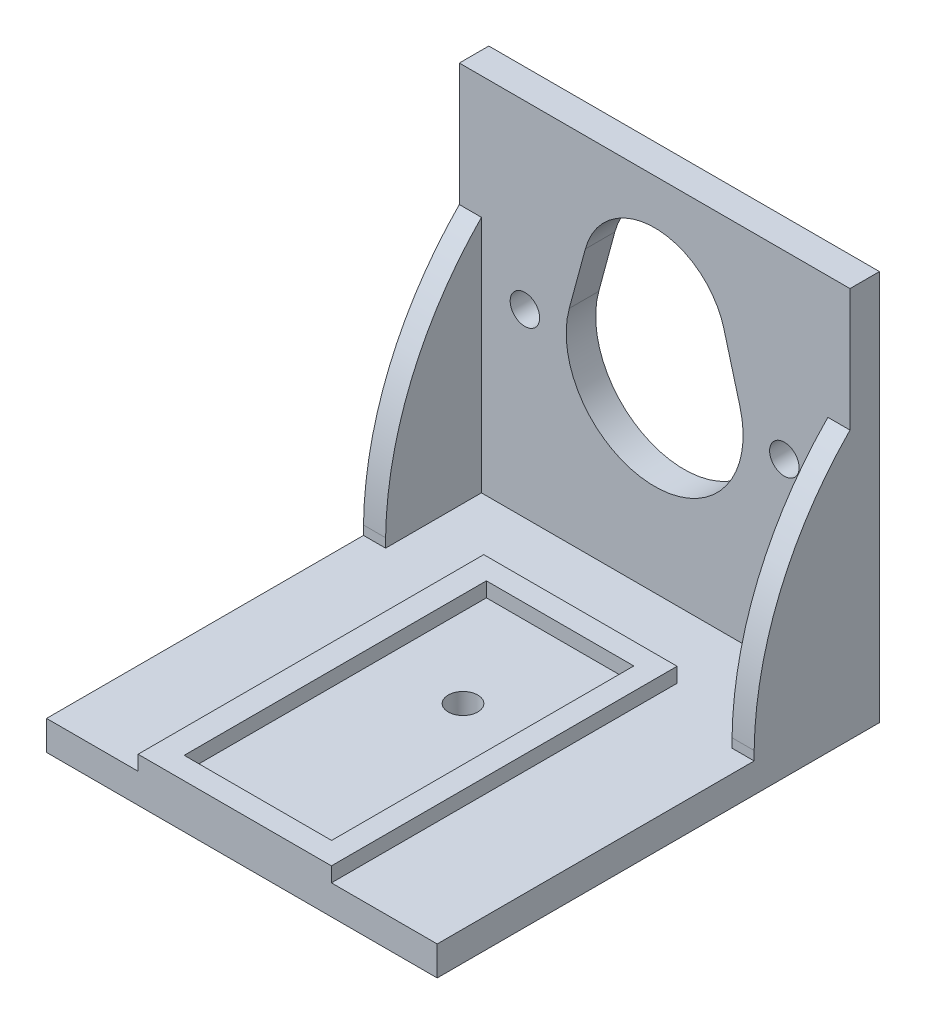
ISO-10303-21;
HEADER;
FILE_DESCRIPTION(('STEP AP214'),'2;1');
FILE_NAME('part.step','',(''),(''),'','','');
FILE_SCHEMA(('AUTOMOTIVE_DESIGN { 1 0 10303 214 1 1 1 1 }'));
ENDSEC;
DATA;
#1=APPLICATION_CONTEXT('core data for automotive mechanical design processes');
#2=APPLICATION_PROTOCOL_DEFINITION('international standard','automotive_design',2000,#1);
#3=PRODUCT_CONTEXT('',#1,'mechanical');
#4=PRODUCT('Part','Part','',(#3));
#5=PRODUCT_RELATED_PRODUCT_CATEGORY('part','',(#4));
#6=PRODUCT_DEFINITION_FORMATION('','',#4);
#7=PRODUCT_DEFINITION_CONTEXT('part definition',#1,'design');
#8=PRODUCT_DEFINITION('design','',#6,#7);
#9=PRODUCT_DEFINITION_SHAPE('','',#8);
#10=(LENGTH_UNIT() NAMED_UNIT(*) SI_UNIT(.MILLI.,.METRE.));
#11=(NAMED_UNIT(*) PLANE_ANGLE_UNIT() SI_UNIT($,.RADIAN.));
#12=(NAMED_UNIT(*) SI_UNIT($,.STERADIAN.) SOLID_ANGLE_UNIT());
#13=UNCERTAINTY_MEASURE_WITH_UNIT(LENGTH_MEASURE(1.E-05),#10,'distance_accuracy_value','');
#14=(GEOMETRIC_REPRESENTATION_CONTEXT(3) GLOBAL_UNCERTAINTY_ASSIGNED_CONTEXT((#13)) GLOBAL_UNIT_ASSIGNED_CONTEXT((#10,
#11,#12)) REPRESENTATION_CONTEXT('',''));
#15=CARTESIAN_POINT('',(0.,0.,0.));
#16=DIRECTION('',(0.,0.,1.));
#17=DIRECTION('',(1.,0.,0.));
#18=AXIS2_PLACEMENT_3D('',#15,#16,#17);
#19=CARTESIAN_POINT('',(0.,4.,60.));
#20=DIRECTION('',(0.,-1.,0.));
#21=DIRECTION('',(0.,0.,-1.));
#22=AXIS2_PLACEMENT_3D('',#19,#20,#21);
#23=PLANE('',#22);
#24=DIRECTION('',(0.,0.,-1.));
#25=VECTOR('',#24,1.);
#26=CARTESIAN_POINT('',(38.6461164607933,4.,60.));
#27=LINE('',#26,#25);
#28=CARTESIAN_POINT('',(38.6461164607933,4.,60.));
#29=VERTEX_POINT('',#28);
#30=CARTESIAN_POINT('',(38.6461164607933,4.,13.1010553588965));
#31=VERTEX_POINT('',#30);
#32=EDGE_CURVE('E275',#29,#31,#27,.T.);
#33=ORIENTED_EDGE('',*,*,#32,.F.);
#34=DIRECTION('',(-1.,0.,0.));
#35=VECTOR('',#34,1.);
#36=CARTESIAN_POINT('',(0.,4.,60.));
#37=LINE('',#36,#35);
#38=CARTESIAN_POINT('',(53.,4.,60.));
#39=VERTEX_POINT('',#38);
#40=EDGE_CURVE('E367',#39,#29,#37,.T.);
#41=ORIENTED_EDGE('',*,*,#40,.F.);
#42=DIRECTION('',(0.,0.,-1.));
#43=VECTOR('',#42,1.);
#44=CARTESIAN_POINT('',(53.,4.,60.));
#45=LINE('',#44,#43);
#46=CARTESIAN_POINT('',(53.,4.,17.));
#47=VERTEX_POINT('',#46);
#48=EDGE_CURVE('E373',#39,#47,#45,.T.);
#49=ORIENTED_EDGE('',*,*,#48,.T.);
#50=DIRECTION('',(1.,0.,0.));
#51=VECTOR('',#50,1.);
#52=CARTESIAN_POINT('',(0.,4.,17.));
#53=LINE('',#52,#51);
#54=CARTESIAN_POINT('',(50.,4.,17.));
#55=VERTEX_POINT('',#54);
#56=EDGE_CURVE('E316',#55,#47,#53,.T.);
#57=ORIENTED_EDGE('',*,*,#56,.F.);
#58=DIRECTION('',(0.,0.,1.));
#59=VECTOR('',#58,1.);
#60=CARTESIAN_POINT('',(50.,4.,60.));
#61=LINE('',#60,#59);
#62=CARTESIAN_POINT('',(50.,4.,4.));
#63=VERTEX_POINT('',#62);
#64=EDGE_CURVE('E310',#63,#55,#61,.T.);
#65=ORIENTED_EDGE('',*,*,#64,.F.);
#66=DIRECTION('',(-1.,0.,0.));
#67=VECTOR('',#66,1.);
#68=CARTESIAN_POINT('',(0.,4.,4.));
#69=LINE('',#68,#67);
#70=CARTESIAN_POINT('',(3.,4.,4.));
#71=VERTEX_POINT('',#70);
#72=EDGE_CURVE('E375',#63,#71,#69,.T.);
#73=ORIENTED_EDGE('',*,*,#72,.T.);
#74=DIRECTION('',(0.,0.,-1.));
#75=VECTOR('',#74,1.);
#76=CARTESIAN_POINT('',(3.,4.,60.));
#77=LINE('',#76,#75);
#78=CARTESIAN_POINT('',(3.,4.,17.));
#79=VERTEX_POINT('',#78);
#80=EDGE_CURVE('E12',#79,#71,#77,.T.);
#81=ORIENTED_EDGE('',*,*,#80,.F.);
#82=DIRECTION('',(-1.,0.,0.));
#83=VECTOR('',#82,1.);
#84=CARTESIAN_POINT('',(0.,4.,17.));
#85=LINE('',#84,#83);
#86=CARTESIAN_POINT('',(0.,4.,17.));
#87=VERTEX_POINT('',#86);
#88=EDGE_CURVE('E66',#79,#87,#85,.T.);
#89=ORIENTED_EDGE('',*,*,#88,.T.);
#90=DIRECTION('',(0.,0.,-1.));
#91=VECTOR('',#90,1.);
#92=CARTESIAN_POINT('',(0.,4.,60.));
#93=LINE('',#92,#91);
#94=CARTESIAN_POINT('',(0.,4.,60.));
#95=VERTEX_POINT('',#94);
#96=EDGE_CURVE('E370',#95,#87,#93,.T.);
#97=ORIENTED_EDGE('',*,*,#96,.F.);
#98=CARTESIAN_POINT('',(12.4175461324136,4.,60.));
#99=VERTEX_POINT('',#98);
#100=EDGE_CURVE('E366',#99,#95,#37,.T.);
#101=ORIENTED_EDGE('',*,*,#100,.F.);
#102=DIRECTION('',(0.,0.,-1.));
#103=VECTOR('',#102,1.);
#104=CARTESIAN_POINT('',(12.4175461324136,4.,60.));
#105=LINE('',#104,#103);
#106=CARTESIAN_POINT('',(12.4175461324136,4.,13.1010553588965));
#107=VERTEX_POINT('',#106);
#108=EDGE_CURVE('E272',#99,#107,#105,.T.);
#109=ORIENTED_EDGE('',*,*,#108,.T.);
#110=DIRECTION('',(1.,0.,0.));
#111=VECTOR('',#110,1.);
#112=CARTESIAN_POINT('',(0.,4.,13.1010553588965));
#113=LINE('',#112,#111);
#114=EDGE_CURVE('E285',#107,#31,#113,.T.);
#115=ORIENTED_EDGE('',*,*,#114,.T.);
#116=EDGE_LOOP('',(#33,#41,#49,#57,#65,#73,#81,#89,#97,#101,#109,#115));
#117=FACE_BOUND('',#116,.T.);
#118=ADVANCED_FACE('F57',(#117),#23,.F.);
#119=CARTESIAN_POINT('',(0.,0.,4.));
#120=DIRECTION('',(0.,0.,-1.));
#121=DIRECTION('',(-1.,0.,0.));
#122=AXIS2_PLACEMENT_3D('',#119,#120,#121);
#123=PLANE('',#122);
#124=DIRECTION('',(0.260962997916829,-0.96534880417301,0.));
#125=VECTOR('',#124,1.);
#126=CARTESIAN_POINT('',(43.4592200258238,11.7483424603005,4.));
#127=LINE('',#126,#125);
#128=CARTESIAN_POINT('',(35.9018011089243,39.7045867259671,4.));
#129=VERTEX_POINT('',#128);
#130=CARTESIAN_POINT('',(38.0841856500761,31.631555975002,4.));
#131=VERTEX_POINT('',#130);
#132=EDGE_CURVE('E354',#129,#131,#127,.T.);
#133=ORIENTED_EDGE('',*,*,#132,.T.);
#134=CARTESIAN_POINT('',(26.5,28.5,4.));
#135=DIRECTION('',(0.,0.,-1.));
#136=DIRECTION('',(-1.,0.,0.));
#137=AXIS2_PLACEMENT_3D('',#134,#135,#136);
#138=CIRCLE('',#137,12.);
#139=CARTESIAN_POINT('',(14.9158143499239,31.631555975002,4.));
#140=VERTEX_POINT('',#139);
#141=EDGE_CURVE('E351',#131,#140,#138,.T.);
#142=ORIENTED_EDGE('',*,*,#141,.T.);
#143=DIRECTION('',(0.26096299791683,0.96534880417301,0.));
#144=VECTOR('',#143,1.);
#145=CARTESIAN_POINT('',(5.93139060124394,-1.60343439223748,4.));
#146=LINE('',#145,#144);
#147=CARTESIAN_POINT('',(17.0981988910757,39.7045867259671,4.));
#148=VERTEX_POINT('',#147);
#149=EDGE_CURVE('E341',#140,#148,#146,.T.);
#150=ORIENTED_EDGE('',*,*,#149,.T.);
#151=CARTESIAN_POINT('',(26.5,37.1629953420066,4.));
#152=DIRECTION('',(0.,0.,-1.));
#153=DIRECTION('',(-1.,0.,0.));
#154=AXIS2_PLACEMENT_3D('',#151,#152,#153);
#155=CIRCLE('',#154,9.73927876461042);
#156=EDGE_CURVE('E356',#148,#129,#155,.T.);
#157=ORIENTED_EDGE('',*,*,#156,.T.);
#158=EDGE_LOOP('',(#133,#142,#150,#157));
#159=FACE_BOUND('',#158,.T.);
#160=CARTESIAN_POINT('',(44.1,28.5,4.));
#161=DIRECTION('',(0.,0.,-1.));
#162=DIRECTION('',(-1.,0.,0.));
#163=AXIS2_PLACEMENT_3D('',#160,#161,#162);
#164=CIRCLE('',#163,2.);
#165=CARTESIAN_POINT('',(42.1,28.5,4.));
#166=VERTEX_POINT('',#165);
#167=EDGE_CURVE('E330',#166,#166,#164,.T.);
#168=ORIENTED_EDGE('',*,*,#167,.T.);
#169=EDGE_LOOP('',(#168));
#170=FACE_BOUND('',#169,.T.);
#171=CARTESIAN_POINT('',(8.9,28.5,4.));
#172=DIRECTION('',(0.,0.,-1.));
#173=DIRECTION('',(-1.,0.,0.));
#174=AXIS2_PLACEMENT_3D('',#171,#172,#173);
#175=CIRCLE('',#174,2.);
#176=CARTESIAN_POINT('',(6.9,28.5,4.));
#177=VERTEX_POINT('',#176);
#178=EDGE_CURVE('E334',#177,#177,#175,.T.);
#179=ORIENTED_EDGE('',*,*,#178,.T.);
#180=EDGE_LOOP('',(#179));
#181=FACE_BOUND('',#180,.T.);
#182=DIRECTION('',(0.,-1.,0.));
#183=VECTOR('',#182,1.);
#184=CARTESIAN_POINT('',(50.,0.,4.));
#185=LINE('',#184,#183);
#186=CARTESIAN_POINT('',(50.,36.3738538523669,4.));
#187=VERTEX_POINT('',#186);
#188=EDGE_CURVE('E313',#187,#63,#185,.T.);
#189=ORIENTED_EDGE('',*,*,#188,.F.);
#190=DIRECTION('',(-1.,0.,0.));
#191=VECTOR('',#190,1.);
#192=CARTESIAN_POINT('',(0.,36.3738538523669,4.));
#193=LINE('',#192,#191);
#194=CARTESIAN_POINT('',(53.,36.3738538523669,4.));
#195=VERTEX_POINT('',#194);
#196=EDGE_CURVE('E308',#195,#187,#193,.T.);
#197=ORIENTED_EDGE('',*,*,#196,.F.);
#198=DIRECTION('',(0.,1.,0.));
#199=VECTOR('',#198,1.);
#200=CARTESIAN_POINT('',(53.,0.,4.));
#201=LINE('',#200,#199);
#202=CARTESIAN_POINT('',(53.,53.,4.));
#203=VERTEX_POINT('',#202);
#204=EDGE_CURVE('E381',#195,#203,#201,.T.);
#205=ORIENTED_EDGE('',*,*,#204,.T.);
#206=DIRECTION('',(-1.,0.,0.));
#207=VECTOR('',#206,1.);
#208=CARTESIAN_POINT('',(0.,53.,4.));
#209=LINE('',#208,#207);
#210=CARTESIAN_POINT('',(0.,53.,4.));
#211=VERTEX_POINT('',#210);
#212=EDGE_CURVE('E384',#203,#211,#209,.T.);
#213=ORIENTED_EDGE('',*,*,#212,.T.);
#214=DIRECTION('',(0.,-1.,0.));
#215=VECTOR('',#214,1.);
#216=CARTESIAN_POINT('',(0.,0.,4.));
#217=LINE('',#216,#215);
#218=CARTESIAN_POINT('',(0.,36.3738538523669,4.));
#219=VERTEX_POINT('',#218);
#220=EDGE_CURVE('E378',#211,#219,#217,.T.);
#221=ORIENTED_EDGE('',*,*,#220,.T.);
#222=DIRECTION('',(-1.,0.,0.));
#223=VECTOR('',#222,1.);
#224=CARTESIAN_POINT('',(0.,36.3738538523669,4.));
#225=LINE('',#224,#223);
#226=CARTESIAN_POINT('',(3.00000000000001,36.3738538523669,4.));
#227=VERTEX_POINT('',#226);
#228=EDGE_CURVE('E327',#227,#219,#225,.T.);
#229=ORIENTED_EDGE('',*,*,#228,.F.);
#230=DIRECTION('',(0.,1.,0.));
#231=VECTOR('',#230,1.);
#232=CARTESIAN_POINT('',(3.,0.,4.));
#233=LINE('',#232,#231);
#234=EDGE_CURVE('E324',#71,#227,#233,.T.);
#235=ORIENTED_EDGE('',*,*,#234,.F.);
#236=ORIENTED_EDGE('',*,*,#72,.F.);
#237=EDGE_LOOP('',(#189,#197,#205,#213,#221,#229,#235,#236));
#238=FACE_BOUND('',#237,.T.);
#239=ADVANCED_FACE('F461',(#159,#170,#181,#238),#123,.F.);
#240=CARTESIAN_POINT('',(0.,0.,4.));
#241=DIRECTION('',(1.,0.,0.));
#242=DIRECTION('',(0.,0.,-1.));
#243=AXIS2_PLACEMENT_3D('',#240,#241,#242);
#244=PLANE('',#243);
#245=DIRECTION('',(0.,-1.,0.));
#246=VECTOR('',#245,1.);
#247=CARTESIAN_POINT('',(0.,36.3738538523669,17.));
#248=LINE('',#247,#246);
#249=CARTESIAN_POINT('',(0.,5.22659799611902,17.));
#250=VERTEX_POINT('',#249);
#251=EDGE_CURVE('E319',#250,#87,#248,.T.);
#252=ORIENTED_EDGE('',*,*,#251,.F.);
#253=CARTESIAN_POINT('',(0.,4.61329899805943,-28.2829503458636));
#254=DIRECTION('',(1.,0.,0.));
#255=DIRECTION('',(0.,0.,-1.));
#256=AXIS2_PLACEMENT_3D('',#253,#254,#255);
#257=CIRCLE('',#256,45.2871033263);
#258=EDGE_CURVE('E300',#250,#219,#257,.F.);
#259=ORIENTED_EDGE('',*,*,#258,.T.);
#260=ORIENTED_EDGE('',*,*,#220,.F.);
#261=DIRECTION('',(0.,0.,-1.));
#262=VECTOR('',#261,1.);
#263=CARTESIAN_POINT('',(0.,53.,4.));
#264=LINE('',#263,#262);
#265=CARTESIAN_POINT('',(0.,53.,0.));
#266=VERTEX_POINT('',#265);
#267=EDGE_CURVE('E386',#211,#266,#264,.T.);
#268=ORIENTED_EDGE('',*,*,#267,.T.);
#269=DIRECTION('',(0.,-1.,0.));
#270=VECTOR('',#269,1.);
#271=CARTESIAN_POINT('',(0.,0.,0.));
#272=LINE('',#271,#270);
#273=CARTESIAN_POINT('',(0.,0.,0.));
#274=VERTEX_POINT('',#273);
#275=EDGE_CURVE('E377',#266,#274,#272,.T.);
#276=ORIENTED_EDGE('',*,*,#275,.T.);
#277=DIRECTION('',(0.,0.,-1.));
#278=VECTOR('',#277,1.);
#279=CARTESIAN_POINT('',(0.,0.,4.));
#280=LINE('',#279,#278);
#281=CARTESIAN_POINT('',(0.,0.,60.));
#282=VERTEX_POINT('',#281);
#283=EDGE_CURVE('E402',#282,#274,#280,.T.);
#284=ORIENTED_EDGE('',*,*,#283,.F.);
#285=DIRECTION('',(0.,-1.,0.));
#286=VECTOR('',#285,1.);
#287=CARTESIAN_POINT('',(0.,0.,60.));
#288=LINE('',#287,#286);
#289=EDGE_CURVE('E359',#95,#282,#288,.T.);
#290=ORIENTED_EDGE('',*,*,#289,.F.);
#291=ORIENTED_EDGE('',*,*,#96,.T.);
#292=EDGE_LOOP('',(#252,#259,#260,#268,#276,#284,#290,#291));
#293=FACE_BOUND('',#292,.T.);
#294=ADVANCED_FACE('F59',(#293),#244,.F.);
#295=CARTESIAN_POINT('',(0.,0.,4.));
#296=DIRECTION('',(0.,1.,0.));
#297=DIRECTION('',(0.,0.,1.));
#298=AXIS2_PLACEMENT_3D('',#295,#296,#297);
#299=PLANE('',#298);
#300=CARTESIAN_POINT('',(26.5,0.,30.));
#301=DIRECTION('',(0.,1.,0.));
#302=DIRECTION('',(0.,0.,1.));
#303=AXIS2_PLACEMENT_3D('',#300,#301,#302);
#304=CIRCLE('',#303,2.);
#305=CARTESIAN_POINT('',(26.5,0.,32.));
#306=VERTEX_POINT('',#305);
#307=EDGE_CURVE('E230',#306,#306,#304,.T.);
#308=ORIENTED_EDGE('',*,*,#307,.T.);
#309=EDGE_LOOP('',(#308));
#310=FACE_BOUND('',#309,.T.);
#311=DIRECTION('',(0.,0.,-1.));
#312=VECTOR('',#311,1.);
#313=CARTESIAN_POINT('',(53.,0.,4.));
#314=LINE('',#313,#312);
#315=CARTESIAN_POINT('',(53.,0.,60.));
#316=VERTEX_POINT('',#315);
#317=CARTESIAN_POINT('',(53.,0.,0.));
#318=VERTEX_POINT('',#317);
#319=EDGE_CURVE('E400',#316,#318,#314,.T.);
#320=ORIENTED_EDGE('',*,*,#319,.F.);
#321=DIRECTION('',(1.,0.,0.));
#322=VECTOR('',#321,1.);
#323=CARTESIAN_POINT('',(0.,0.,60.));
#324=LINE('',#323,#322);
#325=EDGE_CURVE('E362',#282,#316,#324,.T.);
#326=ORIENTED_EDGE('',*,*,#325,.F.);
#327=ORIENTED_EDGE('',*,*,#283,.T.);
#328=DIRECTION('',(1.,0.,0.));
#329=VECTOR('',#328,1.);
#330=CARTESIAN_POINT('',(0.,0.,0.));
#331=LINE('',#330,#329);
#332=EDGE_CURVE('E389',#274,#318,#331,.T.);
#333=ORIENTED_EDGE('',*,*,#332,.T.);
#334=EDGE_LOOP('',(#320,#326,#327,#333));
#335=FACE_BOUND('',#334,.T.);
#336=ADVANCED_FACE('F484',(#310,#335),#299,.F.);
#337=CARTESIAN_POINT('',(53.,0.,4.));
#338=DIRECTION('',(-1.,0.,0.));
#339=DIRECTION('',(0.,0.,1.));
#340=AXIS2_PLACEMENT_3D('',#337,#338,#339);
#341=PLANE('',#340);
#342=ORIENTED_EDGE('',*,*,#204,.F.);
#343=CARTESIAN_POINT('',(53.,4.61329899805943,-28.2829503458636));
#344=DIRECTION('',(-1.,0.,0.));
#345=DIRECTION('',(0.,0.,1.));
#346=AXIS2_PLACEMENT_3D('',#343,#344,#345);
#347=CIRCLE('',#346,45.2871033263);
#348=CARTESIAN_POINT('',(53.,5.22659799611902,17.));
#349=VERTEX_POINT('',#348);
#350=EDGE_CURVE('E297',#195,#349,#347,.F.);
#351=ORIENTED_EDGE('',*,*,#350,.T.);
#352=DIRECTION('',(0.,1.,0.));
#353=VECTOR('',#352,1.);
#354=CARTESIAN_POINT('',(53.,36.3738538523669,17.));
#355=LINE('',#354,#353);
#356=EDGE_CURVE('E305',#47,#349,#355,.T.);
#357=ORIENTED_EDGE('',*,*,#356,.F.);
#358=ORIENTED_EDGE('',*,*,#48,.F.);
#359=DIRECTION('',(0.,1.,0.));
#360=VECTOR('',#359,1.);
#361=CARTESIAN_POINT('',(53.,0.,60.));
#362=LINE('',#361,#360);
#363=EDGE_CURVE('E364',#316,#39,#362,.T.);
#364=ORIENTED_EDGE('',*,*,#363,.F.);
#365=ORIENTED_EDGE('',*,*,#319,.T.);
#366=DIRECTION('',(0.,1.,0.));
#367=VECTOR('',#366,1.);
#368=CARTESIAN_POINT('',(53.,0.,0.));
#369=LINE('',#368,#367);
#370=CARTESIAN_POINT('',(53.,53.,0.));
#371=VERTEX_POINT('',#370);
#372=EDGE_CURVE('E392',#318,#371,#369,.T.);
#373=ORIENTED_EDGE('',*,*,#372,.T.);
#374=DIRECTION('',(0.,0.,-1.));
#375=VECTOR('',#374,1.);
#376=CARTESIAN_POINT('',(53.,53.,4.));
#377=LINE('',#376,#375);
#378=EDGE_CURVE('E397',#203,#371,#377,.T.);
#379=ORIENTED_EDGE('',*,*,#378,.F.);
#380=EDGE_LOOP('',(#342,#351,#357,#358,#364,#365,#373,#379));
#381=FACE_BOUND('',#380,.T.);
#382=ADVANCED_FACE('F449',(#381),#341,.F.);
#383=CARTESIAN_POINT('',(0.,53.,4.));
#384=DIRECTION('',(0.,-1.,0.));
#385=DIRECTION('',(0.,0.,-1.));
#386=AXIS2_PLACEMENT_3D('',#383,#384,#385);
#387=PLANE('',#386);
#388=DIRECTION('',(-1.,0.,0.));
#389=VECTOR('',#388,1.);
#390=CARTESIAN_POINT('',(0.,53.,0.));
#391=LINE('',#390,#389);
#392=EDGE_CURVE('E382',#371,#266,#391,.T.);
#393=ORIENTED_EDGE('',*,*,#392,.T.);
#394=ORIENTED_EDGE('',*,*,#267,.F.);
#395=ORIENTED_EDGE('',*,*,#212,.F.);
#396=ORIENTED_EDGE('',*,*,#378,.T.);
#397=EDGE_LOOP('',(#393,#394,#395,#396));
#398=FACE_BOUND('',#397,.T.);
#399=ADVANCED_FACE('F475',(#398),#387,.F.);
#400=CARTESIAN_POINT('',(0.,0.,0.));
#401=DIRECTION('',(0.,0.,-1.));
#402=DIRECTION('',(-1.,0.,0.));
#403=AXIS2_PLACEMENT_3D('',#400,#401,#402);
#404=PLANE('',#403);
#405=ORIENTED_EDGE('',*,*,#372,.F.);
#406=ORIENTED_EDGE('',*,*,#332,.F.);
#407=ORIENTED_EDGE('',*,*,#275,.F.);
#408=ORIENTED_EDGE('',*,*,#392,.F.);
#409=EDGE_LOOP('',(#405,#406,#407,#408));
#410=FACE_BOUND('',#409,.T.);
#411=CARTESIAN_POINT('',(44.1,28.5,0.));
#412=DIRECTION('',(0.,0.,-1.));
#413=DIRECTION('',(-1.,0.,0.));
#414=AXIS2_PLACEMENT_3D('',#411,#412,#413);
#415=CIRCLE('',#414,2.);
#416=CARTESIAN_POINT('',(42.1,28.5,0.));
#417=VERTEX_POINT('',#416);
#418=EDGE_CURVE('E329',#417,#417,#415,.T.);
#419=ORIENTED_EDGE('',*,*,#418,.F.);
#420=EDGE_LOOP('',(#419));
#421=FACE_BOUND('',#420,.T.);
#422=CARTESIAN_POINT('',(8.9,28.5,0.));
#423=DIRECTION('',(0.,0.,-1.));
#424=DIRECTION('',(-1.,0.,0.));
#425=AXIS2_PLACEMENT_3D('',#422,#423,#424);
#426=CIRCLE('',#425,2.);
#427=CARTESIAN_POINT('',(6.9,28.5,0.));
#428=VERTEX_POINT('',#427);
#429=EDGE_CURVE('E333',#428,#428,#426,.T.);
#430=ORIENTED_EDGE('',*,*,#429,.F.);
#431=EDGE_LOOP('',(#430));
#432=FACE_BOUND('',#431,.T.);
#433=CARTESIAN_POINT('',(26.5,37.1629953420066,0.));
#434=DIRECTION('',(0.,0.,-1.));
#435=DIRECTION('',(-1.,0.,0.));
#436=AXIS2_PLACEMENT_3D('',#433,#434,#435);
#437=CIRCLE('',#436,9.73927876461042);
#438=CARTESIAN_POINT('',(17.0981988910757,39.7045867259671,0.));
#439=VERTEX_POINT('',#438);
#440=CARTESIAN_POINT('',(35.9018011089243,39.7045867259671,0.));
#441=VERTEX_POINT('',#440);
#442=EDGE_CURVE('E411',#439,#441,#437,.T.);
#443=ORIENTED_EDGE('',*,*,#442,.F.);
#444=DIRECTION('',(0.26096299791683,0.96534880417301,0.));
#445=VECTOR('',#444,1.);
#446=CARTESIAN_POINT('',(5.93139060124394,-1.60343439223748,0.));
#447=LINE('',#446,#445);
#448=CARTESIAN_POINT('',(14.9158143499239,31.631555975002,0.));
#449=VERTEX_POINT('',#448);
#450=EDGE_CURVE('E404',#449,#439,#447,.T.);
#451=ORIENTED_EDGE('',*,*,#450,.F.);
#452=CARTESIAN_POINT('',(26.5,28.5,0.));
#453=DIRECTION('',(0.,0.,-1.));
#454=DIRECTION('',(-1.,0.,0.));
#455=AXIS2_PLACEMENT_3D('',#452,#453,#454);
#456=CIRCLE('',#455,12.);
#457=CARTESIAN_POINT('',(38.0841856500761,31.631555975002,0.));
#458=VERTEX_POINT('',#457);
#459=EDGE_CURVE('E406',#458,#449,#456,.T.);
#460=ORIENTED_EDGE('',*,*,#459,.F.);
#461=DIRECTION('',(0.260962997916829,-0.96534880417301,0.));
#462=VECTOR('',#461,1.);
#463=CARTESIAN_POINT('',(43.4592200258238,11.7483424603005,0.));
#464=LINE('',#463,#462);
#465=EDGE_CURVE('E409',#441,#458,#464,.T.);
#466=ORIENTED_EDGE('',*,*,#465,.F.);
#467=EDGE_LOOP('',(#443,#451,#460,#466));
#468=FACE_BOUND('',#467,.T.);
#469=ADVANCED_FACE('F481',(#410,#421,#432,#468),#404,.T.);
#470=CARTESIAN_POINT('',(0.,0.,60.));
#471=DIRECTION('',(0.,0.,-1.));
#472=DIRECTION('',(-1.,0.,0.));
#473=AXIS2_PLACEMENT_3D('',#470,#471,#472);
#474=PLANE('',#473);
#475=ORIENTED_EDGE('',*,*,#325,.T.);
#476=ORIENTED_EDGE('',*,*,#363,.T.);
#477=ORIENTED_EDGE('',*,*,#40,.T.);
#478=DIRECTION('',(0.,-1.,0.));
#479=VECTOR('',#478,1.);
#480=CARTESIAN_POINT('',(38.6461164607933,6.,60.));
#481=LINE('',#480,#479);
#482=CARTESIAN_POINT('',(38.6461164607933,6.,60.));
#483=VERTEX_POINT('',#482);
#484=EDGE_CURVE('E270',#483,#29,#481,.T.);
#485=ORIENTED_EDGE('',*,*,#484,.F.);
#486=DIRECTION('',(1.,0.,0.));
#487=VECTOR('',#486,1.);
#488=CARTESIAN_POINT('',(12.4175461324136,6.,60.));
#489=LINE('',#488,#487);
#490=CARTESIAN_POINT('',(12.4175461324136,6.,60.));
#491=VERTEX_POINT('',#490);
#492=EDGE_CURVE('E237',#491,#483,#489,.T.);
#493=ORIENTED_EDGE('',*,*,#492,.F.);
#494=DIRECTION('',(0.,-1.,0.));
#495=VECTOR('',#494,1.);
#496=CARTESIAN_POINT('',(12.4175461324136,6.,60.));
#497=LINE('',#496,#495);
#498=EDGE_CURVE('E263',#491,#99,#497,.T.);
#499=ORIENTED_EDGE('',*,*,#498,.T.);
#500=ORIENTED_EDGE('',*,*,#100,.T.);
#501=ORIENTED_EDGE('',*,*,#289,.T.);
#502=EDGE_LOOP('',(#475,#476,#477,#485,#493,#499,#500,#501));
#503=FACE_BOUND('',#502,.T.);
#504=ADVANCED_FACE('F430',(#503),#474,.F.);
#505=CARTESIAN_POINT('',(26.5,37.1629953420066,-18.));
#506=DIRECTION('',(0.,0.,1.));
#507=DIRECTION('',(1.,0.,0.));
#508=AXIS2_PLACEMENT_3D('',#505,#506,#507);
#509=CYLINDRICAL_SURFACE('',#508,9.73927876461042);
#510=DIRECTION('',(0.,0.,1.));
#511=VECTOR('',#510,1.);
#512=CARTESIAN_POINT('',(17.0981988910757,39.7045867259671,-18.));
#513=LINE('',#512,#511);
#514=EDGE_CURVE('E337',#439,#148,#513,.T.);
#515=ORIENTED_EDGE('',*,*,#514,.F.);
#516=ORIENTED_EDGE('',*,*,#442,.T.);
#517=DIRECTION('',(0.,0.,1.));
#518=VECTOR('',#517,1.);
#519=CARTESIAN_POINT('',(35.9018011089243,39.7045867259671,-18.));
#520=LINE('',#519,#518);
#521=EDGE_CURVE('E338',#441,#129,#520,.T.);
#522=ORIENTED_EDGE('',*,*,#521,.T.);
#523=ORIENTED_EDGE('',*,*,#156,.F.);
#524=EDGE_LOOP('',(#515,#516,#522,#523));
#525=FACE_BOUND('',#524,.T.);
#526=ADVANCED_FACE('F653',(#525),#509,.F.);
#527=CARTESIAN_POINT('',(35.9018011089243,39.7045867259671,-18.));
#528=DIRECTION('',(0.96534880417301,0.260962997916829,0.));
#529=DIRECTION('',(-0.260962997916829,0.96534880417301,0.));
#530=AXIS2_PLACEMENT_3D('',#527,#528,#529);
#531=PLANE('',#530);
#532=ORIENTED_EDGE('',*,*,#521,.F.);
#533=ORIENTED_EDGE('',*,*,#465,.T.);
#534=DIRECTION('',(0.,0.,1.));
#535=VECTOR('',#534,1.);
#536=CARTESIAN_POINT('',(38.0841856500761,31.631555975002,-18.));
#537=LINE('',#536,#535);
#538=EDGE_CURVE('E342',#458,#131,#537,.T.);
#539=ORIENTED_EDGE('',*,*,#538,.T.);
#540=ORIENTED_EDGE('',*,*,#132,.F.);
#541=EDGE_LOOP('',(#532,#533,#539,#540));
#542=FACE_BOUND('',#541,.T.);
#543=ADVANCED_FACE('F696',(#542),#531,.F.);
#544=CARTESIAN_POINT('',(26.5,28.5,-18.));
#545=DIRECTION('',(0.,0.,1.));
#546=DIRECTION('',(1.,0.,0.));
#547=AXIS2_PLACEMENT_3D('',#544,#545,#546);
#548=CYLINDRICAL_SURFACE('',#547,12.);
#549=ORIENTED_EDGE('',*,*,#538,.F.);
#550=ORIENTED_EDGE('',*,*,#459,.T.);
#551=DIRECTION('',(0.,0.,1.));
#552=VECTOR('',#551,1.);
#553=CARTESIAN_POINT('',(14.9158143499239,31.631555975002,-18.));
#554=LINE('',#553,#552);
#555=EDGE_CURVE('E345',#449,#140,#554,.T.);
#556=ORIENTED_EDGE('',*,*,#555,.T.);
#557=ORIENTED_EDGE('',*,*,#141,.F.);
#558=EDGE_LOOP('',(#549,#550,#556,#557));
#559=FACE_BOUND('',#558,.T.);
#560=ADVANCED_FACE('F704',(#559),#548,.F.);
#561=CARTESIAN_POINT('',(17.0981988910757,39.7045867259671,-18.));
#562=DIRECTION('',(-0.96534880417301,0.26096299791683,0.));
#563=DIRECTION('',(-0.26096299791683,-0.96534880417301,0.));
#564=AXIS2_PLACEMENT_3D('',#561,#562,#563);
#565=PLANE('',#564);
#566=ORIENTED_EDGE('',*,*,#555,.F.);
#567=ORIENTED_EDGE('',*,*,#450,.T.);
#568=ORIENTED_EDGE('',*,*,#514,.T.);
#569=ORIENTED_EDGE('',*,*,#149,.F.);
#570=EDGE_LOOP('',(#566,#567,#568,#569));
#571=FACE_BOUND('',#570,.T.);
#572=ADVANCED_FACE('F711',(#571),#565,.F.);
#573=CARTESIAN_POINT('',(8.9,28.5,-15.));
#574=DIRECTION('',(0.,0.,1.));
#575=DIRECTION('',(1.,0.,0.));
#576=AXIS2_PLACEMENT_3D('',#573,#574,#575);
#577=CYLINDRICAL_SURFACE('',#576,2.);
#578=ORIENTED_EDGE('',*,*,#429,.T.);
#579=EDGE_LOOP('',(#578));
#580=FACE_BOUND('',#579,.T.);
#581=ORIENTED_EDGE('',*,*,#178,.F.);
#582=EDGE_LOOP('',(#581));
#583=FACE_BOUND('',#582,.T.);
#584=ADVANCED_FACE('F719',(#580,#583),#577,.F.);
#585=CARTESIAN_POINT('',(44.1,28.5,-15.));
#586=DIRECTION('',(0.,0.,1.));
#587=DIRECTION('',(1.,0.,0.));
#588=AXIS2_PLACEMENT_3D('',#585,#586,#587);
#589=CYLINDRICAL_SURFACE('',#588,2.);
#590=ORIENTED_EDGE('',*,*,#418,.T.);
#591=EDGE_LOOP('',(#590));
#592=FACE_BOUND('',#591,.T.);
#593=ORIENTED_EDGE('',*,*,#167,.F.);
#594=EDGE_LOOP('',(#593));
#595=FACE_BOUND('',#594,.T.);
#596=ADVANCED_FACE('F578',(#592,#595),#589,.F.);
#597=CARTESIAN_POINT('',(3.,36.3738538523669,17.));
#598=DIRECTION('',(-1.,0.,0.));
#599=DIRECTION('',(0.,-1.,0.));
#600=AXIS2_PLACEMENT_3D('',#597,#598,#599);
#601=PLANE('',#600);
#602=ORIENTED_EDGE('',*,*,#234,.T.);
#603=CARTESIAN_POINT('',(3.,4.61329899805943,-28.2829503458636));
#604=DIRECTION('',(-1.,0.,0.));
#605=DIRECTION('',(0.,-1.,0.));
#606=AXIS2_PLACEMENT_3D('',#603,#604,#605);
#607=CIRCLE('',#606,45.2871033263);
#608=CARTESIAN_POINT('',(3.,5.22659799611902,17.));
#609=VERTEX_POINT('',#608);
#610=EDGE_CURVE('E294',#227,#609,#607,.F.);
#611=ORIENTED_EDGE('',*,*,#610,.T.);
#612=DIRECTION('',(0.,1.,0.));
#613=VECTOR('',#612,1.);
#614=CARTESIAN_POINT('',(3.,36.3738538523669,17.));
#615=LINE('',#614,#613);
#616=EDGE_CURVE('E321',#79,#609,#615,.T.);
#617=ORIENTED_EDGE('',*,*,#616,.F.);
#618=ORIENTED_EDGE('',*,*,#80,.T.);
#619=EDGE_LOOP('',(#602,#611,#617,#618));
#620=FACE_BOUND('',#619,.T.);
#621=ADVANCED_FACE('F465',(#620),#601,.F.);
#622=CARTESIAN_POINT('',(0.,0.,17.));
#623=DIRECTION('',(0.,0.,1.));
#624=DIRECTION('',(1.,0.,0.));
#625=AXIS2_PLACEMENT_3D('',#622,#623,#624);
#626=PLANE('',#625);
#627=DIRECTION('',(1.,0.,0.));
#628=VECTOR('',#627,1.);
#629=CARTESIAN_POINT('',(-15.,5.22659799611902,17.));
#630=LINE('',#629,#628);
#631=EDGE_CURVE('E290',#250,#609,#630,.T.);
#632=ORIENTED_EDGE('',*,*,#631,.F.);
#633=ORIENTED_EDGE('',*,*,#251,.T.);
#634=ORIENTED_EDGE('',*,*,#88,.F.);
#635=ORIENTED_EDGE('',*,*,#616,.T.);
#636=EDGE_LOOP('',(#632,#633,#634,#635));
#637=FACE_BOUND('',#636,.T.);
#638=ADVANCED_FACE('F467',(#637),#626,.T.);
#639=CARTESIAN_POINT('',(0.,0.,17.));
#640=DIRECTION('',(0.,0.,-1.));
#641=DIRECTION('',(-1.,0.,0.));
#642=AXIS2_PLACEMENT_3D('',#639,#640,#641);
#643=PLANE('',#642);
#644=ORIENTED_EDGE('',*,*,#356,.T.);
#645=CARTESIAN_POINT('',(50.,5.22659799611902,17.));
#646=VERTEX_POINT('',#645);
#647=EDGE_CURVE('E288',#646,#349,#630,.T.);
#648=ORIENTED_EDGE('',*,*,#647,.F.);
#649=DIRECTION('',(0.,-1.,0.));
#650=VECTOR('',#649,1.);
#651=CARTESIAN_POINT('',(50.,36.3738538523669,17.));
#652=LINE('',#651,#650);
#653=EDGE_CURVE('E303',#646,#55,#652,.T.);
#654=ORIENTED_EDGE('',*,*,#653,.T.);
#655=ORIENTED_EDGE('',*,*,#56,.T.);
#656=EDGE_LOOP('',(#644,#648,#654,#655));
#657=FACE_BOUND('',#656,.T.);
#658=ADVANCED_FACE('F452',(#657),#643,.F.);
#659=CARTESIAN_POINT('',(50.,36.3738538523669,17.));
#660=DIRECTION('',(1.,0.,0.));
#661=DIRECTION('',(0.,1.,0.));
#662=AXIS2_PLACEMENT_3D('',#659,#660,#661);
#663=PLANE('',#662);
#664=ORIENTED_EDGE('',*,*,#653,.F.);
#665=CARTESIAN_POINT('',(50.,4.61329899805943,-28.2829503458636));
#666=DIRECTION('',(1.,0.,0.));
#667=DIRECTION('',(0.,1.,0.));
#668=AXIS2_PLACEMENT_3D('',#665,#666,#667);
#669=CIRCLE('',#668,45.2871033263);
#670=EDGE_CURVE('E291',#646,#187,#669,.F.);
#671=ORIENTED_EDGE('',*,*,#670,.T.);
#672=ORIENTED_EDGE('',*,*,#188,.T.);
#673=ORIENTED_EDGE('',*,*,#64,.T.);
#674=EDGE_LOOP('',(#664,#671,#672,#673));
#675=FACE_BOUND('',#674,.T.);
#676=ADVANCED_FACE('F456',(#675),#663,.F.);
#677=CARTESIAN_POINT('',(-15.,4.61329899805943,-28.2829503458636));
#678=DIRECTION('',(1.,0.,0.));
#679=DIRECTION('',(0.,0.,-1.));
#680=AXIS2_PLACEMENT_3D('',#677,#678,#679);
#681=CYLINDRICAL_SURFACE('',#680,45.2871033263);
#682=ORIENTED_EDGE('',*,*,#196,.T.);
#683=ORIENTED_EDGE('',*,*,#670,.F.);
#684=ORIENTED_EDGE('',*,*,#647,.T.);
#685=ORIENTED_EDGE('',*,*,#350,.F.);
#686=EDGE_LOOP('',(#682,#683,#684,#685));
#687=FACE_BOUND('',#686,.T.);
#688=ADVANCED_FACE('F486',(#687),#681,.T.);
#689=ORIENTED_EDGE('',*,*,#631,.T.);
#690=ORIENTED_EDGE('',*,*,#610,.F.);
#691=ORIENTED_EDGE('',*,*,#228,.T.);
#692=ORIENTED_EDGE('',*,*,#258,.F.);
#693=EDGE_LOOP('',(#689,#690,#691,#692));
#694=FACE_BOUND('',#693,.T.);
#695=ADVANCED_FACE('F469',(#694),#681,.T.);
#696=CARTESIAN_POINT('',(12.4175461324136,6.,13.1010553588965));
#697=DIRECTION('',(0.,0.,-1.));
#698=DIRECTION('',(-1.,0.,0.));
#699=AXIS2_PLACEMENT_3D('',#696,#697,#698);
#700=PLANE('',#699);
#701=ORIENTED_EDGE('',*,*,#114,.F.);
#702=DIRECTION('',(0.,-1.,0.));
#703=VECTOR('',#702,1.);
#704=CARTESIAN_POINT('',(12.4175461324136,6.,13.1010553588965));
#705=LINE('',#704,#703);
#706=CARTESIAN_POINT('',(12.4175461324136,6.,13.1010553588965));
#707=VERTEX_POINT('',#706);
#708=EDGE_CURVE('E73',#707,#107,#705,.T.);
#709=ORIENTED_EDGE('',*,*,#708,.F.);
#710=DIRECTION('',(1.,0.,0.));
#711=VECTOR('',#710,1.);
#712=CARTESIAN_POINT('',(12.4175461324136,6.,13.1010553588965));
#713=LINE('',#712,#711);
#714=CARTESIAN_POINT('',(38.6461164607933,6.,13.1010553588965));
#715=VERTEX_POINT('',#714);
#716=EDGE_CURVE('E258',#707,#715,#713,.T.);
#717=ORIENTED_EDGE('',*,*,#716,.T.);
#718=DIRECTION('',(0.,-1.,0.));
#719=VECTOR('',#718,1.);
#720=CARTESIAN_POINT('',(38.6461164607933,6.,13.1010553588965));
#721=LINE('',#720,#719);
#722=EDGE_CURVE('E267',#715,#31,#721,.T.);
#723=ORIENTED_EDGE('',*,*,#722,.T.);
#724=EDGE_LOOP('',(#701,#709,#717,#723));
#725=FACE_BOUND('',#724,.T.);
#726=ADVANCED_FACE('F440',(#725),#700,.T.);
#727=CARTESIAN_POINT('',(15.6741135892929,6.,57.));
#728=DIRECTION('',(0.,0.,-1.));
#729=DIRECTION('',(-1.,0.,0.));
#730=AXIS2_PLACEMENT_3D('',#727,#728,#729);
#731=PLANE('',#730);
#732=DIRECTION('',(1.,0.,0.));
#733=VECTOR('',#732,1.);
#734=CARTESIAN_POINT('',(0.,4.,57.));
#735=LINE('',#734,#733);
#736=CARTESIAN_POINT('',(15.6741135892929,4.,57.));
#737=VERTEX_POINT('',#736);
#738=CARTESIAN_POINT('',(35.6741135892929,4.,57.));
#739=VERTEX_POINT('',#738);
#740=EDGE_CURVE('E81',#737,#739,#735,.T.);
#741=ORIENTED_EDGE('',*,*,#740,.F.);
#742=DIRECTION('',(0.,-1.,0.));
#743=VECTOR('',#742,1.);
#744=CARTESIAN_POINT('',(15.6741135892929,6.,57.));
#745=LINE('',#744,#743);
#746=CARTESIAN_POINT('',(15.6741135892929,6.,57.));
#747=VERTEX_POINT('',#746);
#748=EDGE_CURVE('E224',#747,#737,#745,.T.);
#749=ORIENTED_EDGE('',*,*,#748,.F.);
#750=DIRECTION('',(1.,0.,0.));
#751=VECTOR('',#750,1.);
#752=CARTESIAN_POINT('',(15.6741135892929,6.,57.));
#753=LINE('',#752,#751);
#754=CARTESIAN_POINT('',(35.6741135892929,6.,57.));
#755=VERTEX_POINT('',#754);
#756=EDGE_CURVE('E219',#747,#755,#753,.T.);
#757=ORIENTED_EDGE('',*,*,#756,.T.);
#758=DIRECTION('',(0.,-1.,0.));
#759=VECTOR('',#758,1.);
#760=CARTESIAN_POINT('',(35.6741135892929,6.,57.));
#761=LINE('',#760,#759);
#762=EDGE_CURVE('E222',#755,#739,#761,.T.);
#763=ORIENTED_EDGE('',*,*,#762,.T.);
#764=EDGE_LOOP('',(#741,#749,#757,#763));
#765=FACE_BOUND('',#764,.T.);
#766=ADVANCED_FACE('F221',(#765),#731,.T.);
#767=CARTESIAN_POINT('',(35.6741135892929,6.,57.));
#768=DIRECTION('',(-1.,0.,0.));
#769=DIRECTION('',(0.,0.,1.));
#770=AXIS2_PLACEMENT_3D('',#767,#768,#769);
#771=PLANE('',#770);
#772=DIRECTION('',(0.,0.,-1.));
#773=VECTOR('',#772,1.);
#774=CARTESIAN_POINT('',(35.6741135892929,4.,60.));
#775=LINE('',#774,#773);
#776=CARTESIAN_POINT('',(35.6741135892929,4.,16.));
#777=VERTEX_POINT('',#776);
#778=EDGE_CURVE('E236',#739,#777,#775,.T.);
#779=ORIENTED_EDGE('',*,*,#778,.F.);
#780=ORIENTED_EDGE('',*,*,#762,.F.);
#781=DIRECTION('',(0.,0.,-1.));
#782=VECTOR('',#781,1.);
#783=CARTESIAN_POINT('',(35.6741135892929,6.,57.));
#784=LINE('',#783,#782);
#785=CARTESIAN_POINT('',(35.6741135892929,6.,16.));
#786=VERTEX_POINT('',#785);
#787=EDGE_CURVE('E229',#755,#786,#784,.T.);
#788=ORIENTED_EDGE('',*,*,#787,.T.);
#789=DIRECTION('',(0.,-1.,0.));
#790=VECTOR('',#789,1.);
#791=CARTESIAN_POINT('',(35.6741135892929,6.,16.));
#792=LINE('',#791,#790);
#793=EDGE_CURVE('E238',#786,#777,#792,.T.);
#794=ORIENTED_EDGE('',*,*,#793,.T.);
#795=EDGE_LOOP('',(#779,#780,#788,#794));
#796=FACE_BOUND('',#795,.T.);
#797=ADVANCED_FACE('F233',(#796),#771,.T.);
#798=CARTESIAN_POINT('',(15.6741135892929,6.,16.));
#799=DIRECTION('',(0.,0.,-1.));
#800=DIRECTION('',(-1.,0.,0.));
#801=AXIS2_PLACEMENT_3D('',#798,#799,#800);
#802=PLANE('',#801);
#803=DIRECTION('',(0.,-1.,0.));
#804=VECTOR('',#803,1.);
#805=CARTESIAN_POINT('',(15.6741135892929,6.,16.));
#806=LINE('',#805,#804);
#807=CARTESIAN_POINT('',(15.6741135892929,6.,16.));
#808=VERTEX_POINT('',#807);
#809=CARTESIAN_POINT('',(15.6741135892929,4.,16.));
#810=VERTEX_POINT('',#809);
#811=EDGE_CURVE('E250',#808,#810,#806,.T.);
#812=ORIENTED_EDGE('',*,*,#811,.T.);
#813=DIRECTION('',(1.,0.,0.));
#814=VECTOR('',#813,1.);
#815=CARTESIAN_POINT('',(0.,4.,16.));
#816=LINE('',#815,#814);
#817=EDGE_CURVE('E280',#810,#777,#816,.T.);
#818=ORIENTED_EDGE('',*,*,#817,.T.);
#819=ORIENTED_EDGE('',*,*,#793,.F.);
#820=DIRECTION('',(1.,0.,0.));
#821=VECTOR('',#820,1.);
#822=CARTESIAN_POINT('',(15.6741135892929,6.,16.));
#823=LINE('',#822,#821);
#824=EDGE_CURVE('E242',#808,#786,#823,.T.);
#825=ORIENTED_EDGE('',*,*,#824,.F.);
#826=EDGE_LOOP('',(#812,#818,#819,#825));
#827=FACE_BOUND('',#826,.T.);
#828=ADVANCED_FACE('F521',(#827),#802,.F.);
#829=CARTESIAN_POINT('',(15.6741135892929,6.,57.));
#830=DIRECTION('',(-1.,0.,0.));
#831=DIRECTION('',(0.,0.,1.));
#832=AXIS2_PLACEMENT_3D('',#829,#830,#831);
#833=PLANE('',#832);
#834=ORIENTED_EDGE('',*,*,#748,.T.);
#835=DIRECTION('',(0.,0.,-1.));
#836=VECTOR('',#835,1.);
#837=CARTESIAN_POINT('',(15.6741135892929,4.,60.));
#838=LINE('',#837,#836);
#839=EDGE_CURVE('E277',#737,#810,#838,.T.);
#840=ORIENTED_EDGE('',*,*,#839,.T.);
#841=ORIENTED_EDGE('',*,*,#811,.F.);
#842=DIRECTION('',(0.,0.,-1.));
#843=VECTOR('',#842,1.);
#844=CARTESIAN_POINT('',(15.6741135892929,6.,57.));
#845=LINE('',#844,#843);
#846=EDGE_CURVE('E244',#747,#808,#845,.T.);
#847=ORIENTED_EDGE('',*,*,#846,.F.);
#848=EDGE_LOOP('',(#834,#840,#841,#847));
#849=FACE_BOUND('',#848,.T.);
#850=ADVANCED_FACE('F519',(#849),#833,.F.);
#851=CARTESIAN_POINT('',(38.6461164607933,6.,60.));
#852=DIRECTION('',(-1.,0.,0.));
#853=DIRECTION('',(0.,0.,1.));
#854=AXIS2_PLACEMENT_3D('',#851,#852,#853);
#855=PLANE('',#854);
#856=ORIENTED_EDGE('',*,*,#484,.T.);
#857=ORIENTED_EDGE('',*,*,#32,.T.);
#858=ORIENTED_EDGE('',*,*,#722,.F.);
#859=DIRECTION('',(0.,0.,-1.));
#860=VECTOR('',#859,1.);
#861=CARTESIAN_POINT('',(38.6461164607933,6.,60.));
#862=LINE('',#861,#860);
#863=EDGE_CURVE('E256',#483,#715,#862,.T.);
#864=ORIENTED_EDGE('',*,*,#863,.F.);
#865=EDGE_LOOP('',(#856,#857,#858,#864));
#866=FACE_BOUND('',#865,.T.);
#867=ADVANCED_FACE('F442',(#866),#855,.F.);
#868=CARTESIAN_POINT('',(12.4175461324136,6.,60.));
#869=DIRECTION('',(-1.,0.,0.));
#870=DIRECTION('',(0.,0.,1.));
#871=AXIS2_PLACEMENT_3D('',#868,#869,#870);
#872=PLANE('',#871);
#873=ORIENTED_EDGE('',*,*,#108,.F.);
#874=ORIENTED_EDGE('',*,*,#498,.F.);
#875=DIRECTION('',(0.,0.,-1.));
#876=VECTOR('',#875,1.);
#877=CARTESIAN_POINT('',(12.4175461324136,6.,60.));
#878=LINE('',#877,#876);
#879=EDGE_CURVE('E261',#491,#707,#878,.T.);
#880=ORIENTED_EDGE('',*,*,#879,.T.);
#881=ORIENTED_EDGE('',*,*,#708,.T.);
#882=EDGE_LOOP('',(#873,#874,#880,#881));
#883=FACE_BOUND('',#882,.T.);
#884=ADVANCED_FACE('F433',(#883),#872,.T.);
#885=CARTESIAN_POINT('',(0.,6.,0.));
#886=DIRECTION('',(0.,1.,0.));
#887=DIRECTION('',(0.,0.,1.));
#888=AXIS2_PLACEMENT_3D('',#885,#886,#887);
#889=PLANE('',#888);
#890=ORIENTED_EDGE('',*,*,#492,.T.);
#891=ORIENTED_EDGE('',*,*,#863,.T.);
#892=ORIENTED_EDGE('',*,*,#716,.F.);
#893=ORIENTED_EDGE('',*,*,#879,.F.);
#894=EDGE_LOOP('',(#890,#891,#892,#893));
#895=FACE_BOUND('',#894,.T.);
#896=ORIENTED_EDGE('',*,*,#787,.F.);
#897=ORIENTED_EDGE('',*,*,#756,.F.);
#898=ORIENTED_EDGE('',*,*,#846,.T.);
#899=ORIENTED_EDGE('',*,*,#824,.T.);
#900=EDGE_LOOP('',(#896,#897,#898,#899));
#901=FACE_BOUND('',#900,.T.);
#902=ADVANCED_FACE('F241',(#895,#901),#889,.T.);
#903=CARTESIAN_POINT('',(26.5,4.,30.));
#904=DIRECTION('',(0.,-1.,0.));
#905=DIRECTION('',(0.,0.,-1.));
#906=AXIS2_PLACEMENT_3D('',#903,#904,#905);
#907=CIRCLE('',#906,2.);
#908=CARTESIAN_POINT('',(26.5,4.,28.));
#909=VERTEX_POINT('',#908);
#910=EDGE_CURVE('E61',#909,#909,#907,.T.);
#911=ORIENTED_EDGE('',*,*,#910,.T.);
#912=EDGE_LOOP('',(#911));
#913=FACE_BOUND('',#912,.T.);
#914=ORIENTED_EDGE('',*,*,#839,.F.);
#915=ORIENTED_EDGE('',*,*,#740,.T.);
#916=ORIENTED_EDGE('',*,*,#778,.T.);
#917=ORIENTED_EDGE('',*,*,#817,.F.);
#918=EDGE_LOOP('',(#914,#915,#916,#917));
#919=FACE_BOUND('',#918,.T.);
#920=ADVANCED_FACE('F498',(#913,#919),#23,.F.);
#921=CARTESIAN_POINT('',(26.5,-21.,30.));
#922=DIRECTION('',(0.,1.,0.));
#923=DIRECTION('',(0.,0.,1.));
#924=AXIS2_PLACEMENT_3D('',#921,#922,#923);
#925=CYLINDRICAL_SURFACE('',#924,2.);
#926=ORIENTED_EDGE('',*,*,#910,.F.);
#927=EDGE_LOOP('',(#926));
#928=FACE_BOUND('',#927,.T.);
#929=ORIENTED_EDGE('',*,*,#307,.F.);
#930=EDGE_LOOP('',(#929));
#931=FACE_BOUND('',#930,.T.);
#932=ADVANCED_FACE('F506',(#928,#931),#925,.F.);
#933=CLOSED_SHELL('',(#118,#239,#294,#336,#382,#399,#469,#504,#526,#543,#560,#572,#584,#596,
#621,#638,#658,#676,#688,#695,#726,#766,#797,#828,#850,#867,#884,#902,#920,#932));
#934=MANIFOLD_SOLID_BREP('B2',#933);
#935=ADVANCED_BREP_SHAPE_REPRESENTATION('',(#18,#934),#14);
#936=SHAPE_DEFINITION_REPRESENTATION(#9,#935);
ENDSEC;
END-ISO-10303-21;
